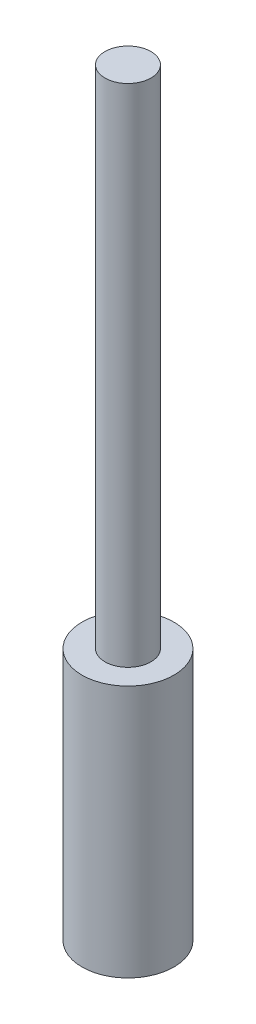
ISO-10303-21;
HEADER;
FILE_DESCRIPTION(('STEP AP214'),'2;1');
FILE_NAME('part.step','',(''),(''),'','','');
FILE_SCHEMA(('AUTOMOTIVE_DESIGN { 1 0 10303 214 1 1 1 1 }'));
ENDSEC;
DATA;
#1=APPLICATION_CONTEXT('core data for automotive mechanical design processes');
#2=APPLICATION_PROTOCOL_DEFINITION('international standard','automotive_design',2000,#1);
#3=PRODUCT_CONTEXT('',#1,'mechanical');
#4=PRODUCT('Part','Part','',(#3));
#5=PRODUCT_RELATED_PRODUCT_CATEGORY('part','',(#4));
#6=PRODUCT_DEFINITION_FORMATION('','',#4);
#7=PRODUCT_DEFINITION_CONTEXT('part definition',#1,'design');
#8=PRODUCT_DEFINITION('design','',#6,#7);
#9=PRODUCT_DEFINITION_SHAPE('','',#8);
#10=(LENGTH_UNIT() NAMED_UNIT(*) SI_UNIT(.MILLI.,.METRE.));
#11=(NAMED_UNIT(*) PLANE_ANGLE_UNIT() SI_UNIT($,.RADIAN.));
#12=(NAMED_UNIT(*) SI_UNIT($,.STERADIAN.) SOLID_ANGLE_UNIT());
#13=UNCERTAINTY_MEASURE_WITH_UNIT(LENGTH_MEASURE(1.E-05),#10,'distance_accuracy_value','');
#14=(GEOMETRIC_REPRESENTATION_CONTEXT(3) GLOBAL_UNCERTAINTY_ASSIGNED_CONTEXT((#13)) GLOBAL_UNIT_ASSIGNED_CONTEXT((#10,
#11,#12)) REPRESENTATION_CONTEXT('',''));
#15=CARTESIAN_POINT('',(0.,0.,0.));
#16=DIRECTION('',(0.,0.,1.));
#17=DIRECTION('',(1.,0.,0.));
#18=AXIS2_PLACEMENT_3D('',#15,#16,#17);
#19=CARTESIAN_POINT('',(0.,55.,0.));
#20=DIRECTION('',(0.,-1.,0.));
#21=DIRECTION('',(0.,0.,-1.));
#22=AXIS2_PLACEMENT_3D('',#19,#20,#21);
#23=CYLINDRICAL_SURFACE('',#22,10.);
#24=CARTESIAN_POINT('',(0.,55.,0.));
#25=DIRECTION('',(0.,1.,0.));
#26=DIRECTION('',(0.,0.,1.));
#27=AXIS2_PLACEMENT_3D('',#24,#25,#26);
#28=CIRCLE('',#27,10.);
#29=CARTESIAN_POINT('',(0.,55.,10.));
#30=VERTEX_POINT('',#29);
#31=EDGE_CURVE('E39',#30,#30,#28,.T.);
#32=ORIENTED_EDGE('',*,*,#31,.F.);
#33=EDGE_LOOP('',(#32));
#34=FACE_BOUND('',#33,.T.);
#35=CARTESIAN_POINT('',(0.,0.,0.));
#36=DIRECTION('',(0.,1.,0.));
#37=DIRECTION('',(0.,0.,1.));
#38=AXIS2_PLACEMENT_3D('',#35,#36,#37);
#39=CIRCLE('',#38,10.);
#40=CARTESIAN_POINT('',(0.,0.,10.));
#41=VERTEX_POINT('',#40);
#42=EDGE_CURVE('E35',#41,#41,#39,.T.);
#43=ORIENTED_EDGE('',*,*,#42,.T.);
#44=EDGE_LOOP('',(#43));
#45=FACE_BOUND('',#44,.T.);
#46=ADVANCED_FACE('F32',(#34,#45),#23,.T.);
#47=CARTESIAN_POINT('',(0.,55.,0.));
#48=DIRECTION('',(0.,1.,0.));
#49=DIRECTION('',(0.,0.,1.));
#50=AXIS2_PLACEMENT_3D('',#47,#48,#49);
#51=PLANE('',#50);
#52=CARTESIAN_POINT('',(0.,55.,0.));
#53=DIRECTION('',(0.,1.,0.));
#54=DIRECTION('',(0.,0.,1.));
#55=AXIS2_PLACEMENT_3D('',#52,#53,#54);
#56=CIRCLE('',#55,5.);
#57=CARTESIAN_POINT('',(0.,55.,5.));
#58=VERTEX_POINT('',#57);
#59=EDGE_CURVE('E10',#58,#58,#56,.T.);
#60=ORIENTED_EDGE('',*,*,#59,.F.);
#61=EDGE_LOOP('',(#60));
#62=FACE_BOUND('',#61,.T.);
#63=ORIENTED_EDGE('',*,*,#31,.T.);
#64=EDGE_LOOP('',(#63));
#65=FACE_BOUND('',#64,.T.);
#66=ADVANCED_FACE('F56',(#62,#65),#51,.T.);
#67=CARTESIAN_POINT('',(0.,0.,0.));
#68=DIRECTION('',(0.,1.,0.));
#69=DIRECTION('',(0.,0.,1.));
#70=AXIS2_PLACEMENT_3D('',#67,#68,#69);
#71=PLANE('',#70);
#72=ORIENTED_EDGE('',*,*,#42,.F.);
#73=EDGE_LOOP('',(#72));
#74=FACE_BOUND('',#73,.T.);
#75=ADVANCED_FACE('F53',(#74),#71,.F.);
#76=CARTESIAN_POINT('',(0.,165.,0.));
#77=DIRECTION('',(0.,-1.,0.));
#78=DIRECTION('',(0.,0.,-1.));
#79=AXIS2_PLACEMENT_3D('',#76,#77,#78);
#80=CYLINDRICAL_SURFACE('',#79,5.);
#81=CARTESIAN_POINT('',(0.,165.,0.));
#82=DIRECTION('',(0.,1.,0.));
#83=DIRECTION('',(0.,0.,1.));
#84=AXIS2_PLACEMENT_3D('',#81,#82,#83);
#85=CIRCLE('',#84,5.);
#86=CARTESIAN_POINT('',(0.,165.,5.));
#87=VERTEX_POINT('',#86);
#88=EDGE_CURVE('E45',#87,#87,#85,.T.);
#89=ORIENTED_EDGE('',*,*,#88,.F.);
#90=EDGE_LOOP('',(#89));
#91=FACE_BOUND('',#90,.T.);
#92=ORIENTED_EDGE('',*,*,#59,.T.);
#93=EDGE_LOOP('',(#92));
#94=FACE_BOUND('',#93,.T.);
#95=ADVANCED_FACE('F55',(#91,#94),#80,.T.);
#96=CARTESIAN_POINT('',(0.,165.,0.));
#97=DIRECTION('',(0.,1.,0.));
#98=DIRECTION('',(0.,0.,1.));
#99=AXIS2_PLACEMENT_3D('',#96,#97,#98);
#100=PLANE('',#99);
#101=ORIENTED_EDGE('',*,*,#88,.T.);
#102=EDGE_LOOP('',(#101));
#103=FACE_BOUND('',#102,.T.);
#104=ADVANCED_FACE('F61',(#103),#100,.T.);
#105=CLOSED_SHELL('',(#46,#66,#75,#95,#104));
#106=MANIFOLD_SOLID_BREP('B2',#105);
#107=ADVANCED_BREP_SHAPE_REPRESENTATION('',(#18,#106),#14);
#108=SHAPE_DEFINITION_REPRESENTATION(#9,#107);
ENDSEC;
END-ISO-10303-21;
